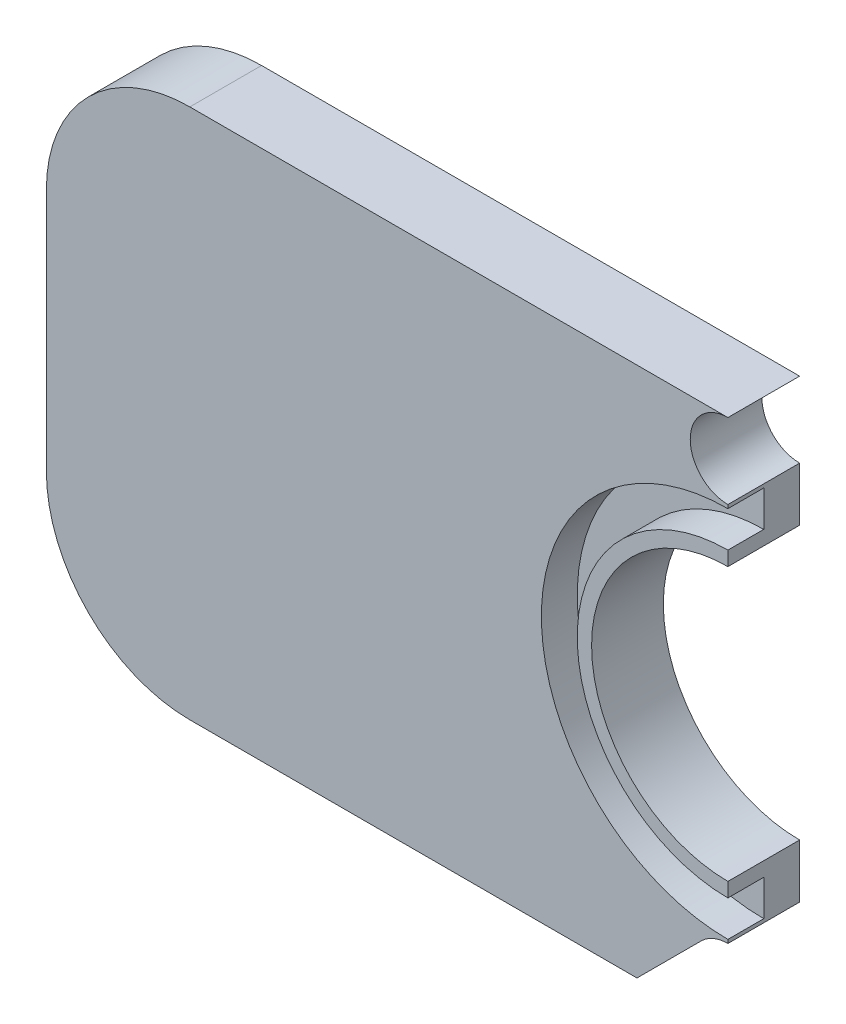
ISO-10303-21;
HEADER;
FILE_DESCRIPTION(('STEP AP214'),'2;1');
FILE_NAME('part.step','',(''),(''),'','','');
FILE_SCHEMA(('AUTOMOTIVE_DESIGN { 1 0 10303 214 1 1 1 1 }'));
ENDSEC;
DATA;
#1=APPLICATION_CONTEXT('core data for automotive mechanical design processes');
#2=APPLICATION_PROTOCOL_DEFINITION('international standard','automotive_design',2000,#1);
#3=PRODUCT_CONTEXT('',#1,'mechanical');
#4=PRODUCT('Part','Part','',(#3));
#5=PRODUCT_RELATED_PRODUCT_CATEGORY('part','',(#4));
#6=PRODUCT_DEFINITION_FORMATION('','',#4);
#7=PRODUCT_DEFINITION_CONTEXT('part definition',#1,'design');
#8=PRODUCT_DEFINITION('design','',#6,#7);
#9=PRODUCT_DEFINITION_SHAPE('','',#8);
#10=(LENGTH_UNIT() NAMED_UNIT(*) SI_UNIT(.MILLI.,.METRE.));
#11=(NAMED_UNIT(*) PLANE_ANGLE_UNIT() SI_UNIT($,.RADIAN.));
#12=(NAMED_UNIT(*) SI_UNIT($,.STERADIAN.) SOLID_ANGLE_UNIT());
#13=UNCERTAINTY_MEASURE_WITH_UNIT(LENGTH_MEASURE(1.E-05),#10,'distance_accuracy_value','');
#14=(GEOMETRIC_REPRESENTATION_CONTEXT(3) GLOBAL_UNCERTAINTY_ASSIGNED_CONTEXT((#13)) GLOBAL_UNIT_ASSIGNED_CONTEXT((#10,
#11,#12)) REPRESENTATION_CONTEXT('',''));
#15=CARTESIAN_POINT('',(0.,0.,0.));
#16=DIRECTION('',(0.,0.,1.));
#17=DIRECTION('',(1.,0.,0.));
#18=AXIS2_PLACEMENT_3D('',#15,#16,#17);
#19=CARTESIAN_POINT('',(-48.1265911761761,0.,10.));
#20=DIRECTION('',(-1.,0.,0.));
#21=DIRECTION('',(0.,-1.,0.));
#22=AXIS2_PLACEMENT_3D('',#19,#20,#21);
#23=PLANE('',#22);
#24=DIRECTION('',(0.,0.,1.));
#25=VECTOR('',#24,1.);
#26=CARTESIAN_POINT('',(-48.1265911761758,-146.667340501082,5.));
#27=LINE('',#26,#25);
#28=CARTESIAN_POINT('',(-48.1265911761758,-146.667340501082,5.));
#29=VERTEX_POINT('',#28);
#30=CARTESIAN_POINT('',(-48.1265911761758,-146.667340501082,10.));
#31=VERTEX_POINT('',#30);
#32=EDGE_CURVE('E169',#29,#31,#27,.T.);
#33=ORIENTED_EDGE('',*,*,#32,.F.);
#34=DIRECTION('',(0.,-1.,0.));
#35=VECTOR('',#34,1.);
#36=CARTESIAN_POINT('',(-48.1265911761761,0.,5.));
#37=LINE('',#36,#35);
#38=CARTESIAN_POINT('',(-48.1265911761758,-151.667340501082,5.));
#39=VERTEX_POINT('',#38);
#40=EDGE_CURVE('E289',#29,#39,#37,.T.);
#41=ORIENTED_EDGE('',*,*,#40,.T.);
#42=DIRECTION('',(0.,0.,1.));
#43=VECTOR('',#42,1.);
#44=CARTESIAN_POINT('',(-48.1265911761758,-151.667340501082,5.));
#45=LINE('',#44,#43);
#46=CARTESIAN_POINT('',(-48.1265911761758,-151.667340501082,10.));
#47=VERTEX_POINT('',#46);
#48=EDGE_CURVE('E279',#39,#47,#45,.T.);
#49=ORIENTED_EDGE('',*,*,#48,.T.);
#50=DIRECTION('',(0.,1.,0.));
#51=VECTOR('',#50,1.);
#52=CARTESIAN_POINT('',(-48.1265911761761,0.,10.));
#53=LINE('',#52,#51);
#54=CARTESIAN_POINT('',(-48.1265911761758,-153.667340501079,10.));
#55=VERTEX_POINT('',#54);
#56=EDGE_CURVE('E292',#55,#47,#53,.T.);
#57=ORIENTED_EDGE('',*,*,#56,.F.);
#58=DIRECTION('',(0.,0.,-1.));
#59=VECTOR('',#58,1.);
#60=CARTESIAN_POINT('',(-48.1265911761758,-153.667340501079,10.));
#61=LINE('',#60,#59);
#62=CARTESIAN_POINT('',(-48.1265911761758,-153.667340501079,0.));
#63=VERTEX_POINT('',#62);
#64=EDGE_CURVE('E11',#55,#63,#61,.T.);
#65=ORIENTED_EDGE('',*,*,#64,.T.);
#66=DIRECTION('',(0.,1.,0.));
#67=VECTOR('',#66,1.);
#68=CARTESIAN_POINT('',(-48.1265911761761,0.,0.));
#69=LINE('',#68,#67);
#70=CARTESIAN_POINT('',(-48.1265911761758,-146.167340501079,0.));
#71=VERTEX_POINT('',#70);
#72=EDGE_CURVE('E168',#63,#71,#69,.T.);
#73=ORIENTED_EDGE('',*,*,#72,.T.);
#74=DIRECTION('',(0.,0.,-1.));
#75=VECTOR('',#74,1.);
#76=CARTESIAN_POINT('',(-48.1265911761758,-146.167340501079,10.));
#77=LINE('',#76,#75);
#78=CARTESIAN_POINT('',(-48.1265911761758,-146.167340501079,10.));
#79=VERTEX_POINT('',#78);
#80=EDGE_CURVE('E44',#79,#71,#77,.T.);
#81=ORIENTED_EDGE('',*,*,#80,.F.);
#82=EDGE_CURVE('E291',#31,#79,#53,.T.);
#83=ORIENTED_EDGE('',*,*,#82,.F.);
#84=EDGE_LOOP('',(#33,#41,#49,#57,#65,#73,#81,#83));
#85=FACE_BOUND('',#84,.T.);
#86=ADVANCED_FACE('F36',(#85),#23,.F.);
#87=CARTESIAN_POINT('',(-48.1265911761754,0.,10.));
#88=DIRECTION('',(-1.,0.,0.));
#89=DIRECTION('',(0.,-1.,0.));
#90=AXIS2_PLACEMENT_3D('',#87,#88,#89);
#91=PLANE('',#90);
#92=DIRECTION('',(0.,0.,1.));
#93=VECTOR('',#92,1.);
#94=CARTESIAN_POINT('',(-48.1265911761758,-198.667340501082,5.));
#95=LINE('',#94,#93);
#96=CARTESIAN_POINT('',(-48.1265911761758,-198.667340501082,5.));
#97=VERTEX_POINT('',#96);
#98=CARTESIAN_POINT('',(-48.1265911761758,-198.667340501082,10.));
#99=VERTEX_POINT('',#98);
#100=EDGE_CURVE('E255',#97,#99,#95,.T.);
#101=ORIENTED_EDGE('',*,*,#100,.T.);
#102=DIRECTION('',(0.,1.,0.));
#103=VECTOR('',#102,1.);
#104=CARTESIAN_POINT('',(-48.1265911761754,0.,10.));
#105=LINE('',#104,#103);
#106=CARTESIAN_POINT('',(-48.1265911761758,-199.167340501079,10.));
#107=VERTEX_POINT('',#106);
#108=EDGE_CURVE('E163',#107,#99,#105,.T.);
#109=ORIENTED_EDGE('',*,*,#108,.F.);
#110=DIRECTION('',(0.,0.,-1.));
#111=VECTOR('',#110,1.);
#112=CARTESIAN_POINT('',(-48.1265911761758,-199.167340501079,10.));
#113=LINE('',#112,#111);
#114=CARTESIAN_POINT('',(-48.1265911761758,-199.167340501079,0.));
#115=VERTEX_POINT('',#114);
#116=EDGE_CURVE('E144',#107,#115,#113,.T.);
#117=ORIENTED_EDGE('',*,*,#116,.T.);
#118=DIRECTION('',(0.,1.,0.));
#119=VECTOR('',#118,1.);
#120=CARTESIAN_POINT('',(-48.1265911761754,0.,0.));
#121=LINE('',#120,#119);
#122=CARTESIAN_POINT('',(-48.1265911761758,-191.667340501079,0.));
#123=VERTEX_POINT('',#122);
#124=EDGE_CURVE('E187',#115,#123,#121,.T.);
#125=ORIENTED_EDGE('',*,*,#124,.T.);
#126=DIRECTION('',(0.,0.,-1.));
#127=VECTOR('',#126,1.);
#128=CARTESIAN_POINT('',(-48.1265911761758,-191.667340501079,10.));
#129=LINE('',#128,#127);
#130=CARTESIAN_POINT('',(-48.1265911761758,-191.667340501079,10.));
#131=VERTEX_POINT('',#130);
#132=EDGE_CURVE('E101',#131,#123,#129,.T.);
#133=ORIENTED_EDGE('',*,*,#132,.F.);
#134=CARTESIAN_POINT('',(-48.1265911761758,-193.667340501082,10.));
#135=VERTEX_POINT('',#134);
#136=EDGE_CURVE('E59',#135,#131,#105,.T.);
#137=ORIENTED_EDGE('',*,*,#136,.F.);
#138=DIRECTION('',(0.,0.,1.));
#139=VECTOR('',#138,1.);
#140=CARTESIAN_POINT('',(-48.1265911761758,-193.667340501082,5.));
#141=LINE('',#140,#139);
#142=CARTESIAN_POINT('',(-48.1265911761758,-193.667340501082,5.));
#143=VERTEX_POINT('',#142);
#144=EDGE_CURVE('E51',#143,#135,#141,.T.);
#145=ORIENTED_EDGE('',*,*,#144,.F.);
#146=DIRECTION('',(0.,-1.,0.));
#147=VECTOR('',#146,1.);
#148=CARTESIAN_POINT('',(-48.1265911761754,0.,5.));
#149=LINE('',#148,#147);
#150=EDGE_CURVE('E334',#143,#97,#149,.T.);
#151=ORIENTED_EDGE('',*,*,#150,.T.);
#152=EDGE_LOOP('',(#101,#109,#117,#125,#133,#137,#145,#151));
#153=FACE_BOUND('',#152,.T.);
#154=ADVANCED_FACE('F251',(#153),#91,.F.);
#155=CARTESIAN_POINT('',(0.,0.,10.));
#156=DIRECTION('',(0.,0.,1.));
#157=DIRECTION('',(1.,0.,0.));
#158=AXIS2_PLACEMENT_3D('',#155,#156,#157);
#159=PLANE('',#158);
#160=ORIENTED_EDGE('',*,*,#108,.T.);
#161=CARTESIAN_POINT('',(-48.126591176176,-172.667340501082,10.));
#162=DIRECTION('',(0.,0.,1.));
#163=DIRECTION('',(1.,0.,0.));
#164=AXIS2_PLACEMENT_3D('',#161,#162,#163);
#165=CIRCLE('',#164,26.);
#166=EDGE_CURVE('E258',#99,#31,#165,.F.);
#167=ORIENTED_EDGE('',*,*,#166,.T.);
#168=ORIENTED_EDGE('',*,*,#82,.T.);
#169=CARTESIAN_POINT('',(-48.1265911761758,-140.917340501079,10.));
#170=DIRECTION('',(0.,0.,1.));
#171=DIRECTION('',(1.,0.,0.));
#172=AXIS2_PLACEMENT_3D('',#169,#170,#171);
#173=CIRCLE('',#172,5.25);
#174=CARTESIAN_POINT('',(-48.1265911761758,-135.667340501079,10.));
#175=VERTEX_POINT('',#174);
#176=EDGE_CURVE('E214',#79,#175,#173,.F.);
#177=ORIENTED_EDGE('',*,*,#176,.T.);
#178=DIRECTION('',(-1.,0.,0.));
#179=VECTOR('',#178,1.);
#180=CARTESIAN_POINT('',(0.,-135.667340501079,10.));
#181=LINE('',#180,#179);
#182=CARTESIAN_POINT('',(-123.133338168327,-135.667340501079,10.));
#183=VERTEX_POINT('',#182);
#184=EDGE_CURVE('E234',#175,#183,#181,.T.);
#185=ORIENTED_EDGE('',*,*,#184,.T.);
#186=CARTESIAN_POINT('',(-123.133338793707,-155.667339932049,10.));
#187=DIRECTION('',(0.,0.,1.));
#188=DIRECTION('',(1.,0.,0.));
#189=AXIS2_PLACEMENT_3D('',#186,#187,#188);
#190=CIRCLE('',#189,19.9999994309701);
#191=CARTESIAN_POINT('',(-143.133338224677,-155.667345000905,10.));
#192=VERTEX_POINT('',#191);
#193=EDGE_CURVE('E231',#183,#192,#190,.T.);
#194=ORIENTED_EDGE('',*,*,#193,.T.);
#195=DIRECTION('',(0.,-1.,0.));
#196=VECTOR('',#195,1.);
#197=CARTESIAN_POINT('',(-143.133338224677,0.,10.));
#198=LINE('',#197,#196);
#199=CARTESIAN_POINT('',(-143.133338224677,-189.667345000905,10.));
#200=VERTEX_POINT('',#199);
#201=EDGE_CURVE('E233',#192,#200,#198,.T.);
#202=ORIENTED_EDGE('',*,*,#201,.T.);
#203=CARTESIAN_POINT('',(-123.133338224677,-189.667344916011,10.));
#204=DIRECTION('',(0.,0.,1.));
#205=DIRECTION('',(1.,0.,0.));
#206=AXIS2_PLACEMENT_3D('',#203,#204,#205);
#207=CIRCLE('',#206,20.);
#208=CARTESIAN_POINT('',(-123.133338139783,-209.667344916011,10.));
#209=VERTEX_POINT('',#208);
#210=EDGE_CURVE('E159',#200,#209,#207,.T.);
#211=ORIENTED_EDGE('',*,*,#210,.T.);
#212=DIRECTION('',(1.,0.,0.));
#213=VECTOR('',#212,1.);
#214=CARTESIAN_POINT('',(0.,-209.667344916011,10.));
#215=LINE('',#214,#213);
#216=CARTESIAN_POINT('',(-60.8012208297447,-209.667344916011,10.));
#217=VERTEX_POINT('',#216);
#218=EDGE_CURVE('E156',#209,#217,#215,.T.);
#219=ORIENTED_EDGE('',*,*,#218,.T.);
#220=DIRECTION('',(-0.707106904338674,-0.707106658034399,0.));
#221=VECTOR('',#220,1.);
#222=CARTESIAN_POINT('',(74.4330726324756,-74.4330985595176,10.));
#223=LINE('',#222,#221);
#224=CARTESIAN_POINT('',(-51.8389026917704,-200.705029899852,10.));
#225=VERTEX_POINT('',#224);
#226=EDGE_CURVE('E138',#225,#217,#223,.T.);
#227=ORIENTED_EDGE('',*,*,#226,.F.);
#228=CARTESIAN_POINT('',(-48.1265911761758,-204.417342708545,10.));
#229=DIRECTION('',(0.,0.,1.));
#230=DIRECTION('',(1.,0.,0.));
#231=AXIS2_PLACEMENT_3D('',#228,#229,#230);
#232=CIRCLE('',#231,5.25000220746617);
#233=EDGE_CURVE('E147',#225,#107,#232,.F.);
#234=ORIENTED_EDGE('',*,*,#233,.T.);
#235=EDGE_LOOP('',(#160,#167,#168,#177,#185,#194,#202,#211,#219,#227,#234));
#236=FACE_BOUND('',#235,.T.);
#237=ADVANCED_FACE('F154',(#236),#159,.T.);
#238=CARTESIAN_POINT('',(-48.1265911761758,-172.667340501079,10.));
#239=DIRECTION('',(0.,0.,-1.));
#240=DIRECTION('',(-1.,0.,0.));
#241=AXIS2_PLACEMENT_3D('',#238,#239,#240);
#242=CYLINDRICAL_SURFACE('',#241,19.);
#243=CARTESIAN_POINT('',(-48.1265911761758,-172.667340501079,0.));
#244=DIRECTION('',(0.,0.,1.));
#245=DIRECTION('',(1.,0.,0.));
#246=AXIS2_PLACEMENT_3D('',#243,#244,#245);
#247=CIRCLE('',#246,19.);
#248=EDGE_CURVE('E165',#63,#123,#247,.T.);
#249=ORIENTED_EDGE('',*,*,#248,.F.);
#250=ORIENTED_EDGE('',*,*,#64,.F.);
#251=CARTESIAN_POINT('',(-48.1265911761758,-172.667340501079,10.));
#252=DIRECTION('',(0.,0.,1.));
#253=DIRECTION('',(1.,0.,0.));
#254=AXIS2_PLACEMENT_3D('',#251,#252,#253);
#255=CIRCLE('',#254,19.);
#256=EDGE_CURVE('E189',#55,#131,#255,.T.);
#257=ORIENTED_EDGE('',*,*,#256,.T.);
#258=ORIENTED_EDGE('',*,*,#132,.T.);
#259=EDGE_LOOP('',(#249,#250,#257,#258));
#260=FACE_BOUND('',#259,.T.);
#261=ADVANCED_FACE('F38',(#260),#242,.F.);
#262=CARTESIAN_POINT('',(-48.1265911761758,-140.917340501079,10.));
#263=DIRECTION('',(0.,0.,-1.));
#264=DIRECTION('',(-1.,0.,0.));
#265=AXIS2_PLACEMENT_3D('',#262,#263,#264);
#266=CYLINDRICAL_SURFACE('',#265,5.25);
#267=CARTESIAN_POINT('',(-48.1265911761758,-140.917340501079,0.));
#268=DIRECTION('',(0.,0.,1.));
#269=DIRECTION('',(1.,0.,0.));
#270=AXIS2_PLACEMENT_3D('',#267,#268,#269);
#271=CIRCLE('',#270,5.25);
#272=CARTESIAN_POINT('',(-48.1265911761758,-135.667340501079,0.));
#273=VERTEX_POINT('',#272);
#274=EDGE_CURVE('E171',#71,#273,#271,.F.);
#275=ORIENTED_EDGE('',*,*,#274,.T.);
#276=DIRECTION('',(0.,0.,-1.));
#277=VECTOR('',#276,1.);
#278=CARTESIAN_POINT('',(-48.1265911761758,-135.667340501079,10.));
#279=LINE('',#278,#277);
#280=EDGE_CURVE('E205',#175,#273,#279,.T.);
#281=ORIENTED_EDGE('',*,*,#280,.F.);
#282=ORIENTED_EDGE('',*,*,#176,.F.);
#283=ORIENTED_EDGE('',*,*,#80,.T.);
#284=EDGE_LOOP('',(#275,#281,#282,#283));
#285=FACE_BOUND('',#284,.T.);
#286=ADVANCED_FACE('F212',(#285),#266,.F.);
#287=CARTESIAN_POINT('',(0.,-135.667340501079,10.));
#288=DIRECTION('',(0.,-1.,0.));
#289=DIRECTION('',(1.,0.,0.));
#290=AXIS2_PLACEMENT_3D('',#287,#288,#289);
#291=PLANE('',#290);
#292=DIRECTION('',(-1.,0.,0.));
#293=VECTOR('',#292,1.);
#294=CARTESIAN_POINT('',(0.,-135.667340501079,0.));
#295=LINE('',#294,#293);
#296=CARTESIAN_POINT('',(-123.133338168327,-135.667340501079,0.));
#297=VERTEX_POINT('',#296);
#298=EDGE_CURVE('E173',#273,#297,#295,.T.);
#299=ORIENTED_EDGE('',*,*,#298,.T.);
#300=DIRECTION('',(0.,0.,-1.));
#301=VECTOR('',#300,1.);
#302=CARTESIAN_POINT('',(-123.133338168327,-135.667340501079,10.));
#303=LINE('',#302,#301);
#304=EDGE_CURVE('E202',#183,#297,#303,.T.);
#305=ORIENTED_EDGE('',*,*,#304,.F.);
#306=ORIENTED_EDGE('',*,*,#184,.F.);
#307=ORIENTED_EDGE('',*,*,#280,.T.);
#308=EDGE_LOOP('',(#299,#305,#306,#307));
#309=FACE_BOUND('',#308,.T.);
#310=ADVANCED_FACE('F225',(#309),#291,.F.);
#311=CARTESIAN_POINT('',(-123.133338793707,-155.667339932049,10.));
#312=DIRECTION('',(0.,0.,-1.));
#313=DIRECTION('',(-1.,0.,0.));
#314=AXIS2_PLACEMENT_3D('',#311,#312,#313);
#315=CYLINDRICAL_SURFACE('',#314,19.9999994309701);
#316=CARTESIAN_POINT('',(-123.133338793707,-155.667339932049,0.));
#317=DIRECTION('',(0.,0.,1.));
#318=DIRECTION('',(1.,0.,0.));
#319=AXIS2_PLACEMENT_3D('',#316,#317,#318);
#320=CIRCLE('',#319,19.9999994309701);
#321=CARTESIAN_POINT('',(-143.133338224677,-155.667345000905,0.));
#322=VERTEX_POINT('',#321);
#323=EDGE_CURVE('E175',#297,#322,#320,.T.);
#324=ORIENTED_EDGE('',*,*,#323,.T.);
#325=DIRECTION('',(0.,0.,-1.));
#326=VECTOR('',#325,1.);
#327=CARTESIAN_POINT('',(-143.133338224677,-155.667345000905,10.));
#328=LINE('',#327,#326);
#329=EDGE_CURVE('E199',#192,#322,#328,.T.);
#330=ORIENTED_EDGE('',*,*,#329,.F.);
#331=ORIENTED_EDGE('',*,*,#193,.F.);
#332=ORIENTED_EDGE('',*,*,#304,.T.);
#333=EDGE_LOOP('',(#324,#330,#331,#332));
#334=FACE_BOUND('',#333,.T.);
#335=ADVANCED_FACE('F229',(#334),#315,.T.);
#336=CARTESIAN_POINT('',(-143.133338224677,0.,10.));
#337=DIRECTION('',(1.,0.,0.));
#338=DIRECTION('',(0.,0.,-1.));
#339=AXIS2_PLACEMENT_3D('',#336,#337,#338);
#340=PLANE('',#339);
#341=DIRECTION('',(0.,-1.,0.));
#342=VECTOR('',#341,1.);
#343=CARTESIAN_POINT('',(-143.133338224677,0.,0.));
#344=LINE('',#343,#342);
#345=CARTESIAN_POINT('',(-143.133338224677,-189.667345000905,0.));
#346=VERTEX_POINT('',#345);
#347=EDGE_CURVE('E177',#322,#346,#344,.T.);
#348=ORIENTED_EDGE('',*,*,#347,.T.);
#349=DIRECTION('',(0.,0.,-1.));
#350=VECTOR('',#349,1.);
#351=CARTESIAN_POINT('',(-143.133338224677,-189.667345000905,10.));
#352=LINE('',#351,#350);
#353=EDGE_CURVE('E196',#200,#346,#352,.T.);
#354=ORIENTED_EDGE('',*,*,#353,.F.);
#355=ORIENTED_EDGE('',*,*,#201,.F.);
#356=ORIENTED_EDGE('',*,*,#329,.T.);
#357=EDGE_LOOP('',(#348,#354,#355,#356));
#358=FACE_BOUND('',#357,.T.);
#359=ADVANCED_FACE('F306',(#358),#340,.F.);
#360=CARTESIAN_POINT('',(-123.133338224677,-189.667344916011,10.));
#361=DIRECTION('',(0.,0.,-1.));
#362=DIRECTION('',(-1.,0.,0.));
#363=AXIS2_PLACEMENT_3D('',#360,#361,#362);
#364=CYLINDRICAL_SURFACE('',#363,20.);
#365=CARTESIAN_POINT('',(-123.133338224677,-189.667344916011,0.));
#366=DIRECTION('',(0.,0.,1.));
#367=DIRECTION('',(1.,0.,0.));
#368=AXIS2_PLACEMENT_3D('',#365,#366,#367);
#369=CIRCLE('',#368,20.);
#370=CARTESIAN_POINT('',(-123.133338139783,-209.667344916011,0.));
#371=VERTEX_POINT('',#370);
#372=EDGE_CURVE('E179',#346,#371,#369,.T.);
#373=ORIENTED_EDGE('',*,*,#372,.T.);
#374=DIRECTION('',(0.,0.,-1.));
#375=VECTOR('',#374,1.);
#376=CARTESIAN_POINT('',(-123.133338139783,-209.667344916011,10.));
#377=LINE('',#376,#375);
#378=EDGE_CURVE('E193',#209,#371,#377,.T.);
#379=ORIENTED_EDGE('',*,*,#378,.F.);
#380=ORIENTED_EDGE('',*,*,#210,.F.);
#381=ORIENTED_EDGE('',*,*,#353,.T.);
#382=EDGE_LOOP('',(#373,#379,#380,#381));
#383=FACE_BOUND('',#382,.T.);
#384=ADVANCED_FACE('F243',(#383),#364,.T.);
#385=CARTESIAN_POINT('',(0.,-209.667344916011,10.));
#386=DIRECTION('',(0.,1.,0.));
#387=DIRECTION('',(-1.,0.,0.));
#388=AXIS2_PLACEMENT_3D('',#385,#386,#387);
#389=PLANE('',#388);
#390=DIRECTION('',(1.,0.,0.));
#391=VECTOR('',#390,1.);
#392=CARTESIAN_POINT('',(0.,-209.667344916011,0.));
#393=LINE('',#392,#391);
#394=CARTESIAN_POINT('',(-60.8012208297447,-209.667344916011,0.));
#395=VERTEX_POINT('',#394);
#396=EDGE_CURVE('E181',#371,#395,#393,.T.);
#397=ORIENTED_EDGE('',*,*,#396,.T.);
#398=DIRECTION('',(0.,0.,-1.));
#399=VECTOR('',#398,1.);
#400=CARTESIAN_POINT('',(-60.8012208297447,-209.667344916011,10.));
#401=LINE('',#400,#399);
#402=EDGE_CURVE('E143',#217,#395,#401,.T.);
#403=ORIENTED_EDGE('',*,*,#402,.F.);
#404=ORIENTED_EDGE('',*,*,#218,.F.);
#405=ORIENTED_EDGE('',*,*,#378,.T.);
#406=EDGE_LOOP('',(#397,#403,#404,#405));
#407=FACE_BOUND('',#406,.T.);
#408=ADVANCED_FACE('F247',(#407),#389,.F.);
#409=CARTESIAN_POINT('',(74.4330726324756,-74.4330985595176,10.));
#410=DIRECTION('',(0.707106658034399,-0.707106904338674,0.));
#411=DIRECTION('',(0.707106904338674,0.707106658034399,0.));
#412=AXIS2_PLACEMENT_3D('',#409,#410,#411);
#413=PLANE('',#412);
#414=DIRECTION('',(-0.707106904338674,-0.707106658034399,0.));
#415=VECTOR('',#414,1.);
#416=CARTESIAN_POINT('',(74.4330726324756,-74.4330985595176,0.));
#417=LINE('',#416,#415);
#418=CARTESIAN_POINT('',(-51.8389026917704,-200.705029899852,0.));
#419=VERTEX_POINT('',#418);
#420=EDGE_CURVE('E140',#419,#395,#417,.T.);
#421=ORIENTED_EDGE('',*,*,#420,.F.);
#422=DIRECTION('',(0.,0.,-1.));
#423=VECTOR('',#422,1.);
#424=CARTESIAN_POINT('',(-51.8389026917704,-200.705029899852,10.));
#425=LINE('',#424,#423);
#426=EDGE_CURVE('E134',#225,#419,#425,.T.);
#427=ORIENTED_EDGE('',*,*,#426,.F.);
#428=ORIENTED_EDGE('',*,*,#226,.T.);
#429=ORIENTED_EDGE('',*,*,#402,.T.);
#430=EDGE_LOOP('',(#421,#427,#428,#429));
#431=FACE_BOUND('',#430,.T.);
#432=ADVANCED_FACE('F136',(#431),#413,.T.);
#433=CARTESIAN_POINT('',(-48.1265911761758,-204.417342708545,10.));
#434=DIRECTION('',(0.,0.,-1.));
#435=DIRECTION('',(-1.,0.,0.));
#436=AXIS2_PLACEMENT_3D('',#433,#434,#435);
#437=CYLINDRICAL_SURFACE('',#436,5.25000220746617);
#438=CARTESIAN_POINT('',(-48.1265911761758,-204.417342708545,0.));
#439=DIRECTION('',(0.,0.,1.));
#440=DIRECTION('',(1.,0.,0.));
#441=AXIS2_PLACEMENT_3D('',#438,#439,#440);
#442=CIRCLE('',#441,5.25000220746617);
#443=EDGE_CURVE('E185',#419,#115,#442,.F.);
#444=ORIENTED_EDGE('',*,*,#443,.T.);
#445=ORIENTED_EDGE('',*,*,#116,.F.);
#446=ORIENTED_EDGE('',*,*,#233,.F.);
#447=ORIENTED_EDGE('',*,*,#426,.T.);
#448=EDGE_LOOP('',(#444,#445,#446,#447));
#449=FACE_BOUND('',#448,.T.);
#450=ADVANCED_FACE('F148',(#449),#437,.F.);
#451=CARTESIAN_POINT('',(-48.126591176176,-172.667340501082,10.));
#452=DIRECTION('',(0.,0.,1.));
#453=DIRECTION('',(1.,0.,0.));
#454=AXIS2_PLACEMENT_3D('',#451,#452,#453);
#455=CIRCLE('',#454,21.);
#456=EDGE_CURVE('E284',#135,#47,#455,.F.);
#457=ORIENTED_EDGE('',*,*,#456,.F.);
#458=ORIENTED_EDGE('',*,*,#136,.T.);
#459=ORIENTED_EDGE('',*,*,#256,.F.);
#460=ORIENTED_EDGE('',*,*,#56,.T.);
#461=EDGE_LOOP('',(#457,#458,#459,#460));
#462=FACE_BOUND('',#461,.T.);
#463=ADVANCED_FACE('F317',(#462),#159,.T.);
#464=CARTESIAN_POINT('',(0.,0.,0.));
#465=DIRECTION('',(0.,0.,1.));
#466=DIRECTION('',(1.,0.,0.));
#467=AXIS2_PLACEMENT_3D('',#464,#465,#466);
#468=PLANE('',#467);
#469=ORIENTED_EDGE('',*,*,#248,.T.);
#470=ORIENTED_EDGE('',*,*,#124,.F.);
#471=ORIENTED_EDGE('',*,*,#443,.F.);
#472=ORIENTED_EDGE('',*,*,#420,.T.);
#473=ORIENTED_EDGE('',*,*,#396,.F.);
#474=ORIENTED_EDGE('',*,*,#372,.F.);
#475=ORIENTED_EDGE('',*,*,#347,.F.);
#476=ORIENTED_EDGE('',*,*,#323,.F.);
#477=ORIENTED_EDGE('',*,*,#298,.F.);
#478=ORIENTED_EDGE('',*,*,#274,.F.);
#479=ORIENTED_EDGE('',*,*,#72,.F.);
#480=EDGE_LOOP('',(#469,#470,#471,#472,#473,#474,#475,#476,#477,#478,#479));
#481=FACE_BOUND('',#480,.T.);
#482=ADVANCED_FACE('F220',(#481),#468,.F.);
#483=CARTESIAN_POINT('',(-48.126591176176,-172.667340501082,5.));
#484=DIRECTION('',(0.,0.,1.));
#485=DIRECTION('',(1.,0.,0.));
#486=AXIS2_PLACEMENT_3D('',#483,#484,#485);
#487=CYLINDRICAL_SURFACE('',#486,26.);
#488=ORIENTED_EDGE('',*,*,#166,.F.);
#489=ORIENTED_EDGE('',*,*,#100,.F.);
#490=CARTESIAN_POINT('',(-48.126591176176,-172.667340501082,5.));
#491=DIRECTION('',(0.,0.,1.));
#492=DIRECTION('',(1.,0.,0.));
#493=AXIS2_PLACEMENT_3D('',#490,#491,#492);
#494=CIRCLE('',#493,26.);
#495=EDGE_CURVE('E277',#97,#29,#494,.F.);
#496=ORIENTED_EDGE('',*,*,#495,.T.);
#497=ORIENTED_EDGE('',*,*,#32,.T.);
#498=EDGE_LOOP('',(#488,#489,#496,#497));
#499=FACE_BOUND('',#498,.T.);
#500=ADVANCED_FACE('F276',(#499),#487,.F.);
#501=CARTESIAN_POINT('',(-48.126591176176,-172.667340501082,5.));
#502=DIRECTION('',(0.,0.,1.));
#503=DIRECTION('',(1.,0.,0.));
#504=AXIS2_PLACEMENT_3D('',#501,#502,#503);
#505=CYLINDRICAL_SURFACE('',#504,21.);
#506=ORIENTED_EDGE('',*,*,#456,.T.);
#507=ORIENTED_EDGE('',*,*,#48,.F.);
#508=CARTESIAN_POINT('',(-48.126591176176,-172.667340501082,5.));
#509=DIRECTION('',(0.,0.,1.));
#510=DIRECTION('',(1.,0.,0.));
#511=AXIS2_PLACEMENT_3D('',#508,#509,#510);
#512=CIRCLE('',#511,21.);
#513=EDGE_CURVE('E336',#143,#39,#512,.F.);
#514=ORIENTED_EDGE('',*,*,#513,.F.);
#515=ORIENTED_EDGE('',*,*,#144,.T.);
#516=EDGE_LOOP('',(#506,#507,#514,#515));
#517=FACE_BOUND('',#516,.T.);
#518=ADVANCED_FACE('F325',(#517),#505,.T.);
#519=CARTESIAN_POINT('',(0.,0.,5.));
#520=DIRECTION('',(0.,0.,1.));
#521=DIRECTION('',(1.,0.,0.));
#522=AXIS2_PLACEMENT_3D('',#519,#520,#521);
#523=PLANE('',#522);
#524=ORIENTED_EDGE('',*,*,#495,.F.);
#525=ORIENTED_EDGE('',*,*,#150,.F.);
#526=ORIENTED_EDGE('',*,*,#513,.T.);
#527=ORIENTED_EDGE('',*,*,#40,.F.);
#528=EDGE_LOOP('',(#524,#525,#526,#527));
#529=FACE_BOUND('',#528,.T.);
#530=ADVANCED_FACE('F328',(#529),#523,.T.);
#531=CLOSED_SHELL('',(#86,#154,#237,#261,#286,#310,#335,#359,#384,#408,#432,#450,#463,#482,#500,
#518,#530));
#532=MANIFOLD_SOLID_BREP('B2',#531);
#533=ADVANCED_BREP_SHAPE_REPRESENTATION('',(#18,#532),#14);
#534=SHAPE_DEFINITION_REPRESENTATION(#9,#533);
ENDSEC;
END-ISO-10303-21;
